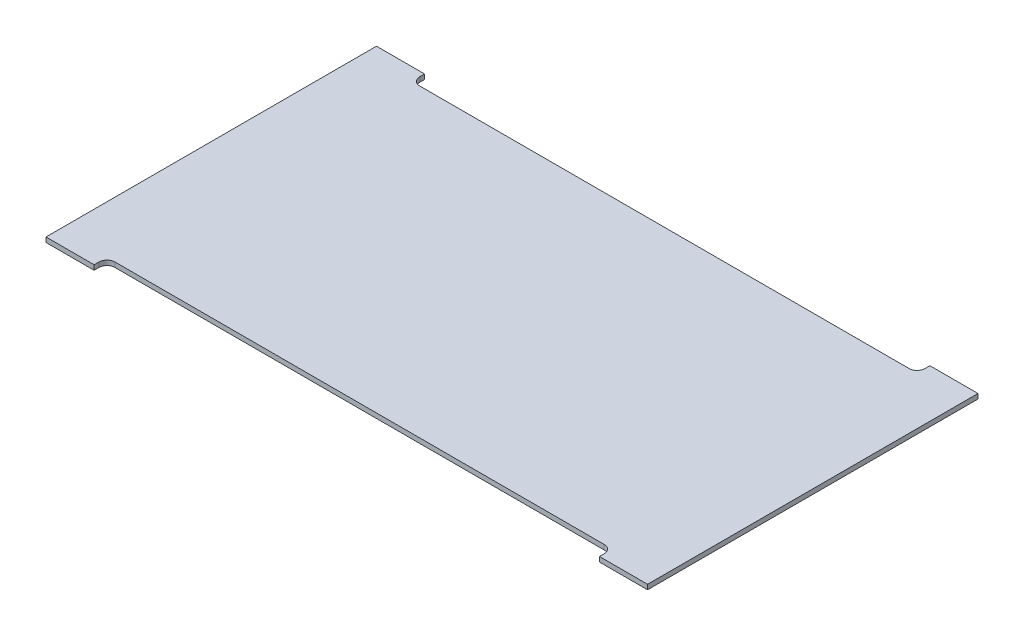
ISO-10303-21;
HEADER;
FILE_DESCRIPTION(('STEP AP214'),'2;1');
FILE_NAME('part.step','',(''),(''),'','','');
FILE_SCHEMA(('AUTOMOTIVE_DESIGN { 1 0 10303 214 1 1 1 1 }'));
ENDSEC;
DATA;
#1=APPLICATION_CONTEXT('core data for automotive mechanical design processes');
#2=APPLICATION_PROTOCOL_DEFINITION('international standard','automotive_design',2000,#1);
#3=PRODUCT_CONTEXT('',#1,'mechanical');
#4=PRODUCT('Part','Part','',(#3));
#5=PRODUCT_RELATED_PRODUCT_CATEGORY('part','',(#4));
#6=PRODUCT_DEFINITION_FORMATION('','',#4);
#7=PRODUCT_DEFINITION_CONTEXT('part definition',#1,'design');
#8=PRODUCT_DEFINITION('design','',#6,#7);
#9=PRODUCT_DEFINITION_SHAPE('','',#8);
#10=(LENGTH_UNIT() NAMED_UNIT(*) SI_UNIT(.MILLI.,.METRE.));
#11=(NAMED_UNIT(*) PLANE_ANGLE_UNIT() SI_UNIT($,.RADIAN.));
#12=(NAMED_UNIT(*) SI_UNIT($,.STERADIAN.) SOLID_ANGLE_UNIT());
#13=UNCERTAINTY_MEASURE_WITH_UNIT(LENGTH_MEASURE(1.E-05),#10,'distance_accuracy_value','');
#14=(GEOMETRIC_REPRESENTATION_CONTEXT(3) GLOBAL_UNCERTAINTY_ASSIGNED_CONTEXT((#13)) GLOBAL_UNIT_ASSIGNED_CONTEXT((#10,
#11,#12)) REPRESENTATION_CONTEXT('',''));
#15=CARTESIAN_POINT('',(0.,0.,0.));
#16=DIRECTION('',(0.,0.,1.));
#17=DIRECTION('',(1.,0.,0.));
#18=AXIS2_PLACEMENT_3D('',#15,#16,#17);
#19=CARTESIAN_POINT('',(-690.,6.,0.));
#20=DIRECTION('',(-1.,0.,0.));
#21=DIRECTION('',(0.,0.,1.));
#22=AXIS2_PLACEMENT_3D('',#19,#20,#21);
#23=PLANE('',#22);
#24=DIRECTION('',(0.,0.,-1.));
#25=VECTOR('',#24,1.);
#26=CARTESIAN_POINT('',(-690.,0.,0.));
#27=LINE('',#26,#25);
#28=CARTESIAN_POINT('',(-690.,0.,16.0000000000001));
#29=VERTEX_POINT('',#28);
#30=CARTESIAN_POINT('',(-690.,0.,10.0000000000001));
#31=VERTEX_POINT('',#30);
#32=EDGE_CURVE('E186',#29,#31,#27,.T.);
#33=ORIENTED_EDGE('',*,*,#32,.T.);
#34=DIRECTION('',(0.,-1.,0.));
#35=VECTOR('',#34,1.);
#36=CARTESIAN_POINT('',(-690.,6.,10.0000000000001));
#37=LINE('',#36,#35);
#38=CARTESIAN_POINT('',(-690.,6.,10.0000000000001));
#39=VERTEX_POINT('',#38);
#40=EDGE_CURVE('E246',#31,#39,#37,.F.);
#41=ORIENTED_EDGE('',*,*,#40,.T.);
#42=DIRECTION('',(0.,0.,-1.));
#43=VECTOR('',#42,1.);
#44=CARTESIAN_POINT('',(-690.,6.,0.));
#45=LINE('',#44,#43);
#46=CARTESIAN_POINT('',(-690.,6.,16.0000000000001));
#47=VERTEX_POINT('',#46);
#48=EDGE_CURVE('E213',#47,#39,#45,.T.);
#49=ORIENTED_EDGE('',*,*,#48,.F.);
#50=DIRECTION('',(0.,-1.,0.));
#51=VECTOR('',#50,1.);
#52=CARTESIAN_POINT('',(-690.,6.,16.0000000000001));
#53=LINE('',#52,#51);
#54=EDGE_CURVE('E185',#47,#29,#53,.T.);
#55=ORIENTED_EDGE('',*,*,#54,.T.);
#56=EDGE_LOOP('',(#33,#41,#49,#55));
#57=FACE_BOUND('',#56,.T.);
#58=ADVANCED_FACE('F32',(#57),#23,.F.);
#59=CARTESIAN_POINT('',(-60.,6.,0.));
#60=DIRECTION('',(0.,0.,-1.));
#61=DIRECTION('',(-1.,0.,0.));
#62=AXIS2_PLACEMENT_3D('',#59,#60,#61);
#63=PLANE('',#62);
#64=DIRECTION('',(1.,0.,0.));
#65=VECTOR('',#64,1.);
#66=CARTESIAN_POINT('',(-60.,6.,0.));
#67=LINE('',#66,#65);
#68=CARTESIAN_POINT('',(-680.,6.,0.));
#69=VERTEX_POINT('',#68);
#70=CARTESIAN_POINT('',(-70.,6.,0.));
#71=VERTEX_POINT('',#70);
#72=EDGE_CURVE('E149',#69,#71,#67,.T.);
#73=ORIENTED_EDGE('',*,*,#72,.F.);
#74=DIRECTION('',(0.,-1.,0.));
#75=VECTOR('',#74,1.);
#76=CARTESIAN_POINT('',(-680.,0.,0.));
#77=LINE('',#76,#75);
#78=CARTESIAN_POINT('',(-680.,0.,0.));
#79=VERTEX_POINT('',#78);
#80=EDGE_CURVE('E243',#69,#79,#77,.T.);
#81=ORIENTED_EDGE('',*,*,#80,.T.);
#82=DIRECTION('',(1.,0.,0.));
#83=VECTOR('',#82,1.);
#84=CARTESIAN_POINT('',(-60.,0.,0.));
#85=LINE('',#84,#83);
#86=CARTESIAN_POINT('',(-70.,0.,0.));
#87=VERTEX_POINT('',#86);
#88=EDGE_CURVE('E189',#79,#87,#85,.T.);
#89=ORIENTED_EDGE('',*,*,#88,.T.);
#90=DIRECTION('',(0.,-1.,0.));
#91=VECTOR('',#90,1.);
#92=CARTESIAN_POINT('',(-70.,6.,0.));
#93=LINE('',#92,#91);
#94=EDGE_CURVE('E241',#87,#71,#93,.F.);
#95=ORIENTED_EDGE('',*,*,#94,.T.);
#96=EDGE_LOOP('',(#73,#81,#89,#95));
#97=FACE_BOUND('',#96,.T.);
#98=ADVANCED_FACE('F267',(#97),#63,.F.);
#99=CARTESIAN_POINT('',(-60.,6.,0.));
#100=DIRECTION('',(1.,0.,0.));
#101=DIRECTION('',(0.,0.,-1.));
#102=AXIS2_PLACEMENT_3D('',#99,#100,#101);
#103=PLANE('',#102);
#104=DIRECTION('',(0.,0.,1.));
#105=VECTOR('',#104,1.);
#106=CARTESIAN_POINT('',(-60.,6.,0.));
#107=LINE('',#106,#105);
#108=CARTESIAN_POINT('',(-60.,6.,10.0000000000001));
#109=VERTEX_POINT('',#108);
#110=CARTESIAN_POINT('',(-60.,6.,16.));
#111=VERTEX_POINT('',#110);
#112=EDGE_CURVE('E141',#109,#111,#107,.T.);
#113=ORIENTED_EDGE('',*,*,#112,.F.);
#114=DIRECTION('',(0.,-1.,0.));
#115=VECTOR('',#114,1.);
#116=CARTESIAN_POINT('',(-60.,0.,10.0000000000001));
#117=LINE('',#116,#115);
#118=CARTESIAN_POINT('',(-60.,0.,10.0000000000001));
#119=VERTEX_POINT('',#118);
#120=EDGE_CURVE('E248',#109,#119,#117,.T.);
#121=ORIENTED_EDGE('',*,*,#120,.T.);
#122=DIRECTION('',(0.,0.,1.));
#123=VECTOR('',#122,1.);
#124=CARTESIAN_POINT('',(-60.,0.,0.));
#125=LINE('',#124,#123);
#126=CARTESIAN_POINT('',(-60.,0.,16.));
#127=VERTEX_POINT('',#126);
#128=EDGE_CURVE('E155',#119,#127,#125,.T.);
#129=ORIENTED_EDGE('',*,*,#128,.T.);
#130=DIRECTION('',(0.,-1.,0.));
#131=VECTOR('',#130,1.);
#132=CARTESIAN_POINT('',(-60.,6.,16.));
#133=LINE('',#132,#131);
#134=EDGE_CURVE('E152',#111,#127,#133,.T.);
#135=ORIENTED_EDGE('',*,*,#134,.F.);
#136=EDGE_LOOP('',(#113,#121,#129,#135));
#137=FACE_BOUND('',#136,.T.);
#138=ADVANCED_FACE('F153',(#137),#103,.F.);
#139=CARTESIAN_POINT('',(0.,6.,16.));
#140=DIRECTION('',(0.,0.,-1.));
#141=DIRECTION('',(-1.,0.,0.));
#142=AXIS2_PLACEMENT_3D('',#139,#140,#141);
#143=PLANE('',#142);
#144=DIRECTION('',(1.,0.,0.));
#145=VECTOR('',#144,1.);
#146=CARTESIAN_POINT('',(0.,0.,16.));
#147=LINE('',#146,#145);
#148=CARTESIAN_POINT('',(0.,0.,16.));
#149=VERTEX_POINT('',#148);
#150=EDGE_CURVE('E193',#127,#149,#147,.T.);
#151=ORIENTED_EDGE('',*,*,#150,.T.);
#152=DIRECTION('',(0.,-1.,0.));
#153=VECTOR('',#152,1.);
#154=CARTESIAN_POINT('',(0.,6.,16.));
#155=LINE('',#154,#153);
#156=CARTESIAN_POINT('',(0.,6.,16.));
#157=VERTEX_POINT('',#156);
#158=EDGE_CURVE('E159',#157,#149,#155,.T.);
#159=ORIENTED_EDGE('',*,*,#158,.F.);
#160=DIRECTION('',(1.,0.,0.));
#161=VECTOR('',#160,1.);
#162=CARTESIAN_POINT('',(0.,6.,16.));
#163=LINE('',#162,#161);
#164=EDGE_CURVE('E146',#111,#157,#163,.T.);
#165=ORIENTED_EDGE('',*,*,#164,.F.);
#166=ORIENTED_EDGE('',*,*,#134,.T.);
#167=EDGE_LOOP('',(#151,#159,#165,#166));
#168=FACE_BOUND('',#167,.T.);
#169=ADVANCED_FACE('F161',(#168),#143,.F.);
#170=CARTESIAN_POINT('',(0.,6.,-396.));
#171=DIRECTION('',(-1.,0.,0.));
#172=DIRECTION('',(0.,0.,1.));
#173=AXIS2_PLACEMENT_3D('',#170,#171,#172);
#174=PLANE('',#173);
#175=DIRECTION('',(0.,0.,-1.));
#176=VECTOR('',#175,1.);
#177=CARTESIAN_POINT('',(0.,0.,-396.));
#178=LINE('',#177,#176);
#179=CARTESIAN_POINT('',(0.,0.,-396.));
#180=VERTEX_POINT('',#179);
#181=EDGE_CURVE('E195',#149,#180,#178,.T.);
#182=ORIENTED_EDGE('',*,*,#181,.T.);
#183=DIRECTION('',(0.,-1.,0.));
#184=VECTOR('',#183,1.);
#185=CARTESIAN_POINT('',(0.,6.,-396.));
#186=LINE('',#185,#184);
#187=CARTESIAN_POINT('',(0.,6.,-396.));
#188=VERTEX_POINT('',#187);
#189=EDGE_CURVE('E228',#188,#180,#186,.T.);
#190=ORIENTED_EDGE('',*,*,#189,.F.);
#191=DIRECTION('',(0.,0.,-1.));
#192=VECTOR('',#191,1.);
#193=CARTESIAN_POINT('',(0.,6.,-396.));
#194=LINE('',#193,#192);
#195=EDGE_CURVE('E164',#157,#188,#194,.T.);
#196=ORIENTED_EDGE('',*,*,#195,.F.);
#197=ORIENTED_EDGE('',*,*,#158,.T.);
#198=EDGE_LOOP('',(#182,#190,#196,#197));
#199=FACE_BOUND('',#198,.T.);
#200=ADVANCED_FACE('F339',(#199),#174,.F.);
#201=CARTESIAN_POINT('',(0.,6.,-396.));
#202=DIRECTION('',(0.,0.,1.));
#203=DIRECTION('',(1.,0.,0.));
#204=AXIS2_PLACEMENT_3D('',#201,#202,#203);
#205=PLANE('',#204);
#206=DIRECTION('',(-1.,0.,0.));
#207=VECTOR('',#206,1.);
#208=CARTESIAN_POINT('',(0.,0.,-396.));
#209=LINE('',#208,#207);
#210=CARTESIAN_POINT('',(-60.0000000000001,0.,-396.));
#211=VERTEX_POINT('',#210);
#212=EDGE_CURVE('E197',#180,#211,#209,.T.);
#213=ORIENTED_EDGE('',*,*,#212,.T.);
#214=DIRECTION('',(0.,-1.,0.));
#215=VECTOR('',#214,1.);
#216=CARTESIAN_POINT('',(-60.0000000000001,6.,-396.));
#217=LINE('',#216,#215);
#218=CARTESIAN_POINT('',(-60.0000000000001,6.,-396.));
#219=VERTEX_POINT('',#218);
#220=EDGE_CURVE('E225',#219,#211,#217,.T.);
#221=ORIENTED_EDGE('',*,*,#220,.F.);
#222=DIRECTION('',(-1.,0.,0.));
#223=VECTOR('',#222,1.);
#224=CARTESIAN_POINT('',(0.,6.,-396.));
#225=LINE('',#224,#223);
#226=EDGE_CURVE('E166',#188,#219,#225,.T.);
#227=ORIENTED_EDGE('',*,*,#226,.F.);
#228=ORIENTED_EDGE('',*,*,#189,.T.);
#229=EDGE_LOOP('',(#213,#221,#227,#228));
#230=FACE_BOUND('',#229,.T.);
#231=ADVANCED_FACE('F335',(#230),#205,.F.);
#232=CARTESIAN_POINT('',(-59.9999999999999,6.,-380.));
#233=DIRECTION('',(1.,0.,0.));
#234=DIRECTION('',(0.,0.,-1.));
#235=AXIS2_PLACEMENT_3D('',#232,#233,#234);
#236=PLANE('',#235);
#237=DIRECTION('',(0.,0.,1.));
#238=VECTOR('',#237,1.);
#239=CARTESIAN_POINT('',(-59.9999999999999,0.,-380.));
#240=LINE('',#239,#238);
#241=CARTESIAN_POINT('',(-60.,0.,-390.));
#242=VERTEX_POINT('',#241);
#243=EDGE_CURVE('E199',#211,#242,#240,.T.);
#244=ORIENTED_EDGE('',*,*,#243,.T.);
#245=DIRECTION('',(0.,-1.,0.));
#246=VECTOR('',#245,1.);
#247=CARTESIAN_POINT('',(-60.,6.,-390.));
#248=LINE('',#247,#246);
#249=CARTESIAN_POINT('',(-60.,6.,-390.));
#250=VERTEX_POINT('',#249);
#251=EDGE_CURVE('E236',#242,#250,#248,.F.);
#252=ORIENTED_EDGE('',*,*,#251,.T.);
#253=DIRECTION('',(0.,0.,1.));
#254=VECTOR('',#253,1.);
#255=CARTESIAN_POINT('',(-59.9999999999999,6.,-380.));
#256=LINE('',#255,#254);
#257=EDGE_CURVE('E171',#219,#250,#256,.T.);
#258=ORIENTED_EDGE('',*,*,#257,.F.);
#259=ORIENTED_EDGE('',*,*,#220,.T.);
#260=EDGE_LOOP('',(#244,#252,#258,#259));
#261=FACE_BOUND('',#260,.T.);
#262=ADVANCED_FACE('F330',(#261),#236,.F.);
#263=CARTESIAN_POINT('',(-59.9999999999999,6.,-380.));
#264=DIRECTION('',(0.,0.,1.));
#265=DIRECTION('',(1.,0.,0.));
#266=AXIS2_PLACEMENT_3D('',#263,#264,#265);
#267=PLANE('',#266);
#268=DIRECTION('',(-1.,0.,0.));
#269=VECTOR('',#268,1.);
#270=CARTESIAN_POINT('',(-59.9999999999999,6.,-380.));
#271=LINE('',#270,#269);
#272=CARTESIAN_POINT('',(-70.,6.,-380.));
#273=VERTEX_POINT('',#272);
#274=CARTESIAN_POINT('',(-680.,6.,-380.));
#275=VERTEX_POINT('',#274);
#276=EDGE_CURVE('E174',#273,#275,#271,.T.);
#277=ORIENTED_EDGE('',*,*,#276,.F.);
#278=DIRECTION('',(0.,-1.,0.));
#279=VECTOR('',#278,1.);
#280=CARTESIAN_POINT('',(-70.,0.,-380.));
#281=LINE('',#280,#279);
#282=CARTESIAN_POINT('',(-70.,0.,-380.));
#283=VERTEX_POINT('',#282);
#284=EDGE_CURVE('E233',#273,#283,#281,.T.);
#285=ORIENTED_EDGE('',*,*,#284,.T.);
#286=DIRECTION('',(-1.,0.,0.));
#287=VECTOR('',#286,1.);
#288=CARTESIAN_POINT('',(-59.9999999999999,0.,-380.));
#289=LINE('',#288,#287);
#290=CARTESIAN_POINT('',(-680.,0.,-380.));
#291=VERTEX_POINT('',#290);
#292=EDGE_CURVE('E202',#283,#291,#289,.T.);
#293=ORIENTED_EDGE('',*,*,#292,.T.);
#294=DIRECTION('',(0.,-1.,0.));
#295=VECTOR('',#294,1.);
#296=CARTESIAN_POINT('',(-680.,6.,-380.));
#297=LINE('',#296,#295);
#298=EDGE_CURVE('E158',#291,#275,#297,.F.);
#299=ORIENTED_EDGE('',*,*,#298,.T.);
#300=EDGE_LOOP('',(#277,#285,#293,#299));
#301=FACE_BOUND('',#300,.T.);
#302=ADVANCED_FACE('F323',(#301),#267,.F.);
#303=CARTESIAN_POINT('',(-690.,6.,-380.));
#304=DIRECTION('',(-1.,0.,0.));
#305=DIRECTION('',(0.,0.,1.));
#306=AXIS2_PLACEMENT_3D('',#303,#304,#305);
#307=PLANE('',#306);
#308=DIRECTION('',(0.,0.,-1.));
#309=VECTOR('',#308,1.);
#310=CARTESIAN_POINT('',(-690.,6.,-380.));
#311=LINE('',#310,#309);
#312=CARTESIAN_POINT('',(-690.,6.,-390.));
#313=VERTEX_POINT('',#312);
#314=CARTESIAN_POINT('',(-690.,6.,-396.));
#315=VERTEX_POINT('',#314);
#316=EDGE_CURVE('E177',#313,#315,#311,.T.);
#317=ORIENTED_EDGE('',*,*,#316,.F.);
#318=DIRECTION('',(0.,-1.,0.));
#319=VECTOR('',#318,1.);
#320=CARTESIAN_POINT('',(-690.,0.,-390.));
#321=LINE('',#320,#319);
#322=CARTESIAN_POINT('',(-690.,0.,-390.));
#323=VERTEX_POINT('',#322);
#324=EDGE_CURVE('E238',#313,#323,#321,.T.);
#325=ORIENTED_EDGE('',*,*,#324,.T.);
#326=DIRECTION('',(0.,0.,-1.));
#327=VECTOR('',#326,1.);
#328=CARTESIAN_POINT('',(-690.,0.,-380.));
#329=LINE('',#328,#327);
#330=CARTESIAN_POINT('',(-690.,0.,-396.));
#331=VERTEX_POINT('',#330);
#332=EDGE_CURVE('E205',#323,#331,#329,.T.);
#333=ORIENTED_EDGE('',*,*,#332,.T.);
#334=DIRECTION('',(0.,-1.,0.));
#335=VECTOR('',#334,1.);
#336=CARTESIAN_POINT('',(-690.,6.,-396.));
#337=LINE('',#336,#335);
#338=EDGE_CURVE('E222',#315,#331,#337,.T.);
#339=ORIENTED_EDGE('',*,*,#338,.F.);
#340=EDGE_LOOP('',(#317,#325,#333,#339));
#341=FACE_BOUND('',#340,.T.);
#342=ADVANCED_FACE('F300',(#341),#307,.F.);
#343=CARTESIAN_POINT('',(-750.,6.,-396.));
#344=DIRECTION('',(0.,0.,1.));
#345=DIRECTION('',(1.,0.,0.));
#346=AXIS2_PLACEMENT_3D('',#343,#344,#345);
#347=PLANE('',#346);
#348=DIRECTION('',(-1.,0.,0.));
#349=VECTOR('',#348,1.);
#350=CARTESIAN_POINT('',(-750.,0.,-396.));
#351=LINE('',#350,#349);
#352=CARTESIAN_POINT('',(-750.,0.,-396.));
#353=VERTEX_POINT('',#352);
#354=EDGE_CURVE('E207',#331,#353,#351,.T.);
#355=ORIENTED_EDGE('',*,*,#354,.T.);
#356=DIRECTION('',(0.,-1.,0.));
#357=VECTOR('',#356,1.);
#358=CARTESIAN_POINT('',(-750.,6.,-396.));
#359=LINE('',#358,#357);
#360=CARTESIAN_POINT('',(-750.,6.,-396.));
#361=VERTEX_POINT('',#360);
#362=EDGE_CURVE('E219',#361,#353,#359,.T.);
#363=ORIENTED_EDGE('',*,*,#362,.F.);
#364=DIRECTION('',(-1.,0.,0.));
#365=VECTOR('',#364,1.);
#366=CARTESIAN_POINT('',(-750.,6.,-396.));
#367=LINE('',#366,#365);
#368=EDGE_CURVE('E179',#315,#361,#367,.T.);
#369=ORIENTED_EDGE('',*,*,#368,.F.);
#370=ORIENTED_EDGE('',*,*,#338,.T.);
#371=EDGE_LOOP('',(#355,#363,#369,#370));
#372=FACE_BOUND('',#371,.T.);
#373=ADVANCED_FACE('F306',(#372),#347,.F.);
#374=CARTESIAN_POINT('',(-750.,6.,-396.));
#375=DIRECTION('',(1.,0.,0.));
#376=DIRECTION('',(0.,0.,-1.));
#377=AXIS2_PLACEMENT_3D('',#374,#375,#376);
#378=PLANE('',#377);
#379=DIRECTION('',(0.,0.,1.));
#380=VECTOR('',#379,1.);
#381=CARTESIAN_POINT('',(-750.,0.,-396.));
#382=LINE('',#381,#380);
#383=CARTESIAN_POINT('',(-750.,0.,16.0000000000001));
#384=VERTEX_POINT('',#383);
#385=EDGE_CURVE('E209',#353,#384,#382,.T.);
#386=ORIENTED_EDGE('',*,*,#385,.T.);
#387=DIRECTION('',(0.,-1.,0.));
#388=VECTOR('',#387,1.);
#389=CARTESIAN_POINT('',(-750.,6.,16.0000000000001));
#390=LINE('',#389,#388);
#391=CARTESIAN_POINT('',(-750.,6.,16.0000000000001));
#392=VERTEX_POINT('',#391);
#393=EDGE_CURVE('E216',#392,#384,#390,.T.);
#394=ORIENTED_EDGE('',*,*,#393,.F.);
#395=DIRECTION('',(0.,0.,1.));
#396=VECTOR('',#395,1.);
#397=CARTESIAN_POINT('',(-750.,6.,-396.));
#398=LINE('',#397,#396);
#399=EDGE_CURVE('E181',#361,#392,#398,.T.);
#400=ORIENTED_EDGE('',*,*,#399,.F.);
#401=ORIENTED_EDGE('',*,*,#362,.T.);
#402=EDGE_LOOP('',(#386,#394,#400,#401));
#403=FACE_BOUND('',#402,.T.);
#404=ADVANCED_FACE('F312',(#403),#378,.F.);
#405=CARTESIAN_POINT('',(-750.,6.,16.0000000000001));
#406=DIRECTION('',(0.,0.,-1.));
#407=DIRECTION('',(-1.,0.,0.));
#408=AXIS2_PLACEMENT_3D('',#405,#406,#407);
#409=PLANE('',#408);
#410=DIRECTION('',(1.,0.,0.));
#411=VECTOR('',#410,1.);
#412=CARTESIAN_POINT('',(-750.,0.,16.0000000000001));
#413=LINE('',#412,#411);
#414=EDGE_CURVE('E211',#384,#29,#413,.T.);
#415=ORIENTED_EDGE('',*,*,#414,.T.);
#416=ORIENTED_EDGE('',*,*,#54,.F.);
#417=DIRECTION('',(1.,0.,0.));
#418=VECTOR('',#417,1.);
#419=CARTESIAN_POINT('',(-750.,6.,16.0000000000001));
#420=LINE('',#419,#418);
#421=EDGE_CURVE('E183',#392,#47,#420,.T.);
#422=ORIENTED_EDGE('',*,*,#421,.F.);
#423=ORIENTED_EDGE('',*,*,#393,.T.);
#424=EDGE_LOOP('',(#415,#416,#422,#423));
#425=FACE_BOUND('',#424,.T.);
#426=ADVANCED_FACE('F316',(#425),#409,.F.);
#427=CARTESIAN_POINT('',(0.,6.,0.));
#428=DIRECTION('',(0.,1.,0.));
#429=DIRECTION('',(0.,0.,1.));
#430=AXIS2_PLACEMENT_3D('',#427,#428,#429);
#431=PLANE('',#430);
#432=ORIENTED_EDGE('',*,*,#48,.T.);
#433=CARTESIAN_POINT('',(-680.,6.,10.0000000000001));
#434=DIRECTION('',(0.,1.,0.));
#435=DIRECTION('',(0.,0.,1.));
#436=AXIS2_PLACEMENT_3D('',#433,#434,#435);
#437=CIRCLE('',#436,10.);
#438=EDGE_CURVE('E260',#39,#69,#437,.F.);
#439=ORIENTED_EDGE('',*,*,#438,.T.);
#440=ORIENTED_EDGE('',*,*,#72,.T.);
#441=CARTESIAN_POINT('',(-70.,6.,10.0000000000001));
#442=DIRECTION('',(0.,1.,0.));
#443=DIRECTION('',(0.,0.,1.));
#444=AXIS2_PLACEMENT_3D('',#441,#442,#443);
#445=CIRCLE('',#444,10.);
#446=EDGE_CURVE('E11',#71,#109,#445,.F.);
#447=ORIENTED_EDGE('',*,*,#446,.T.);
#448=ORIENTED_EDGE('',*,*,#112,.T.);
#449=ORIENTED_EDGE('',*,*,#164,.T.);
#450=ORIENTED_EDGE('',*,*,#195,.T.);
#451=ORIENTED_EDGE('',*,*,#226,.T.);
#452=ORIENTED_EDGE('',*,*,#257,.T.);
#453=CARTESIAN_POINT('',(-70.,6.,-390.));
#454=DIRECTION('',(0.,1.,0.));
#455=DIRECTION('',(0.,0.,1.));
#456=AXIS2_PLACEMENT_3D('',#453,#454,#455);
#457=CIRCLE('',#456,10.);
#458=EDGE_CURVE('E252',#250,#273,#457,.F.);
#459=ORIENTED_EDGE('',*,*,#458,.T.);
#460=ORIENTED_EDGE('',*,*,#276,.T.);
#461=CARTESIAN_POINT('',(-680.,6.,-390.));
#462=DIRECTION('',(0.,1.,0.));
#463=DIRECTION('',(0.,0.,1.));
#464=AXIS2_PLACEMENT_3D('',#461,#462,#463);
#465=CIRCLE('',#464,10.);
#466=EDGE_CURVE('E256',#275,#313,#465,.F.);
#467=ORIENTED_EDGE('',*,*,#466,.T.);
#468=ORIENTED_EDGE('',*,*,#316,.T.);
#469=ORIENTED_EDGE('',*,*,#368,.T.);
#470=ORIENTED_EDGE('',*,*,#399,.T.);
#471=ORIENTED_EDGE('',*,*,#421,.T.);
#472=EDGE_LOOP('',(#432,#439,#440,#447,#448,#449,#450,#451,#452,#459,#460,#467,#468,#469,#470,#471));
#473=FACE_BOUND('',#472,.T.);
#474=ADVANCED_FACE('F144',(#473),#431,.T.);
#475=CARTESIAN_POINT('',(0.,0.,0.));
#476=DIRECTION('',(0.,1.,0.));
#477=DIRECTION('',(0.,0.,1.));
#478=AXIS2_PLACEMENT_3D('',#475,#476,#477);
#479=PLANE('',#478);
#480=ORIENTED_EDGE('',*,*,#32,.F.);
#481=ORIENTED_EDGE('',*,*,#414,.F.);
#482=ORIENTED_EDGE('',*,*,#385,.F.);
#483=ORIENTED_EDGE('',*,*,#354,.F.);
#484=ORIENTED_EDGE('',*,*,#332,.F.);
#485=CARTESIAN_POINT('',(-680.,0.,-390.));
#486=DIRECTION('',(0.,1.,0.));
#487=DIRECTION('',(0.,0.,1.));
#488=AXIS2_PLACEMENT_3D('',#485,#486,#487);
#489=CIRCLE('',#488,10.);
#490=EDGE_CURVE('E254',#323,#291,#489,.T.);
#491=ORIENTED_EDGE('',*,*,#490,.T.);
#492=ORIENTED_EDGE('',*,*,#292,.F.);
#493=CARTESIAN_POINT('',(-70.,0.,-390.));
#494=DIRECTION('',(0.,1.,0.));
#495=DIRECTION('',(0.,0.,1.));
#496=AXIS2_PLACEMENT_3D('',#493,#494,#495);
#497=CIRCLE('',#496,10.);
#498=EDGE_CURVE('E250',#283,#242,#497,.T.);
#499=ORIENTED_EDGE('',*,*,#498,.T.);
#500=ORIENTED_EDGE('',*,*,#243,.F.);
#501=ORIENTED_EDGE('',*,*,#212,.F.);
#502=ORIENTED_EDGE('',*,*,#181,.F.);
#503=ORIENTED_EDGE('',*,*,#150,.F.);
#504=ORIENTED_EDGE('',*,*,#128,.F.);
#505=CARTESIAN_POINT('',(-70.,0.,10.0000000000001));
#506=DIRECTION('',(0.,1.,0.));
#507=DIRECTION('',(0.,0.,1.));
#508=AXIS2_PLACEMENT_3D('',#505,#506,#507);
#509=CIRCLE('',#508,10.);
#510=EDGE_CURVE('E40',#119,#87,#509,.T.);
#511=ORIENTED_EDGE('',*,*,#510,.T.);
#512=ORIENTED_EDGE('',*,*,#88,.F.);
#513=CARTESIAN_POINT('',(-680.,0.,10.0000000000001));
#514=DIRECTION('',(0.,1.,0.));
#515=DIRECTION('',(0.,0.,1.));
#516=AXIS2_PLACEMENT_3D('',#513,#514,#515);
#517=CIRCLE('',#516,10.);
#518=EDGE_CURVE('E258',#79,#31,#517,.T.);
#519=ORIENTED_EDGE('',*,*,#518,.T.);
#520=EDGE_LOOP('',(#480,#481,#482,#483,#484,#491,#492,#499,#500,#501,#502,#503,#504,#511,#512,#519));
#521=FACE_BOUND('',#520,.T.);
#522=ADVANCED_FACE('F264',(#521),#479,.F.);
#523=CARTESIAN_POINT('',(-70.,6.,-390.));
#524=DIRECTION('',(0.,1.,0.));
#525=DIRECTION('',(0.,0.,1.));
#526=AXIS2_PLACEMENT_3D('',#523,#524,#525);
#527=CYLINDRICAL_SURFACE('',#526,10.);
#528=ORIENTED_EDGE('',*,*,#458,.F.);
#529=ORIENTED_EDGE('',*,*,#251,.F.);
#530=ORIENTED_EDGE('',*,*,#498,.F.);
#531=ORIENTED_EDGE('',*,*,#284,.F.);
#532=EDGE_LOOP('',(#528,#529,#530,#531));
#533=FACE_BOUND('',#532,.T.);
#534=ADVANCED_FACE('F285',(#533),#527,.F.);
#535=CARTESIAN_POINT('',(-680.,6.,-390.));
#536=DIRECTION('',(0.,1.,0.));
#537=DIRECTION('',(0.,0.,1.));
#538=AXIS2_PLACEMENT_3D('',#535,#536,#537);
#539=CYLINDRICAL_SURFACE('',#538,10.);
#540=ORIENTED_EDGE('',*,*,#466,.F.);
#541=ORIENTED_EDGE('',*,*,#298,.F.);
#542=ORIENTED_EDGE('',*,*,#490,.F.);
#543=ORIENTED_EDGE('',*,*,#324,.F.);
#544=EDGE_LOOP('',(#540,#541,#542,#543));
#545=FACE_BOUND('',#544,.T.);
#546=ADVANCED_FACE('F274',(#545),#539,.F.);
#547=CARTESIAN_POINT('',(-680.,6.,10.0000000000001));
#548=DIRECTION('',(0.,1.,0.));
#549=DIRECTION('',(0.,0.,1.));
#550=AXIS2_PLACEMENT_3D('',#547,#548,#549);
#551=CYLINDRICAL_SURFACE('',#550,10.);
#552=ORIENTED_EDGE('',*,*,#438,.F.);
#553=ORIENTED_EDGE('',*,*,#40,.F.);
#554=ORIENTED_EDGE('',*,*,#518,.F.);
#555=ORIENTED_EDGE('',*,*,#80,.F.);
#556=EDGE_LOOP('',(#552,#553,#554,#555));
#557=FACE_BOUND('',#556,.T.);
#558=ADVANCED_FACE('F270',(#557),#551,.F.);
#559=CARTESIAN_POINT('',(-70.,6.,10.0000000000001));
#560=DIRECTION('',(0.,1.,0.));
#561=DIRECTION('',(0.,0.,1.));
#562=AXIS2_PLACEMENT_3D('',#559,#560,#561);
#563=CYLINDRICAL_SURFACE('',#562,10.);
#564=ORIENTED_EDGE('',*,*,#446,.F.);
#565=ORIENTED_EDGE('',*,*,#94,.F.);
#566=ORIENTED_EDGE('',*,*,#510,.F.);
#567=ORIENTED_EDGE('',*,*,#120,.F.);
#568=EDGE_LOOP('',(#564,#565,#566,#567));
#569=FACE_BOUND('',#568,.T.);
#570=ADVANCED_FACE('F34',(#569),#563,.F.);
#571=CLOSED_SHELL('',(#58,#98,#138,#169,#200,#231,#262,#302,#342,#373,#404,#426,#474,#522,#534,
#546,#558,#570));
#572=MANIFOLD_SOLID_BREP('B2',#571);
#573=ADVANCED_BREP_SHAPE_REPRESENTATION('',(#18,#572),#14);
#574=SHAPE_DEFINITION_REPRESENTATION(#9,#573);
ENDSEC;
END-ISO-10303-21;
